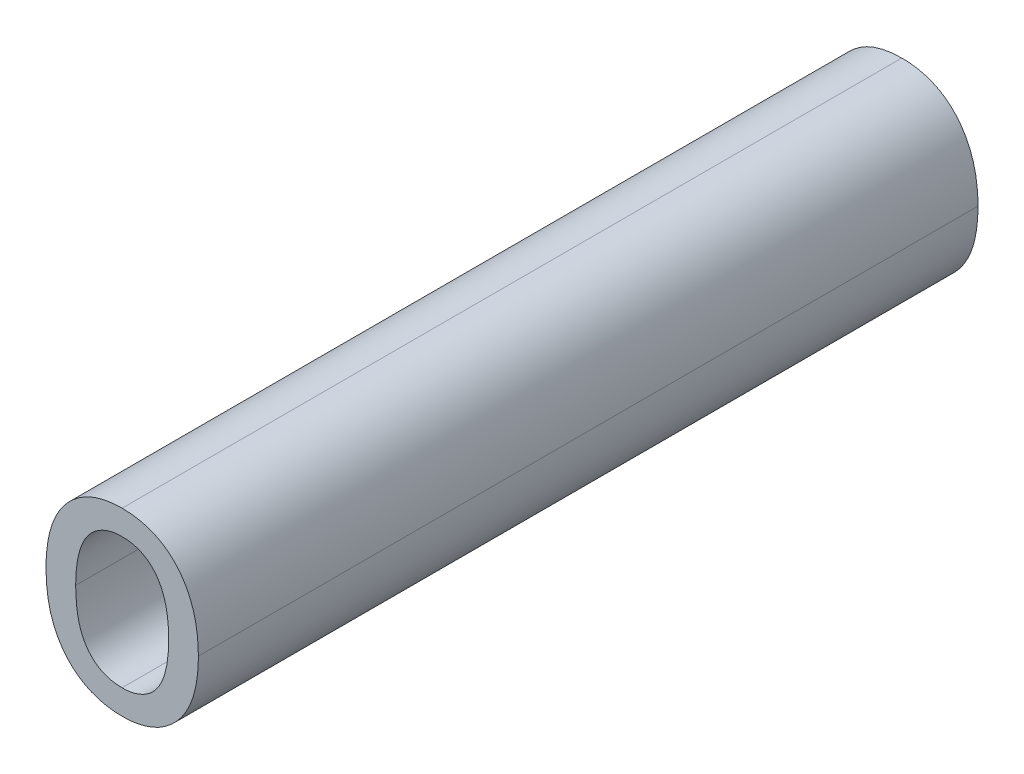
ISO-10303-21;
HEADER;
FILE_DESCRIPTION(('STEP AP214'),'2;1');
FILE_NAME('part.step','',(''),(''),'','','');
FILE_SCHEMA(('AUTOMOTIVE_DESIGN { 1 0 10303 214 1 1 1 1 }'));
ENDSEC;
DATA;
#1=APPLICATION_CONTEXT('core data for automotive mechanical design processes');
#2=APPLICATION_PROTOCOL_DEFINITION('international standard','automotive_design',2000,#1);
#3=PRODUCT_CONTEXT('',#1,'mechanical');
#4=PRODUCT('Part','Part','',(#3));
#5=PRODUCT_RELATED_PRODUCT_CATEGORY('part','',(#4));
#6=PRODUCT_DEFINITION_FORMATION('','',#4);
#7=PRODUCT_DEFINITION_CONTEXT('part definition',#1,'design');
#8=PRODUCT_DEFINITION('design','',#6,#7);
#9=PRODUCT_DEFINITION_SHAPE('','',#8);
#10=(LENGTH_UNIT() NAMED_UNIT(*) SI_UNIT(.MILLI.,.METRE.));
#11=(NAMED_UNIT(*) PLANE_ANGLE_UNIT() SI_UNIT($,.RADIAN.));
#12=(NAMED_UNIT(*) SI_UNIT($,.STERADIAN.) SOLID_ANGLE_UNIT());
#13=UNCERTAINTY_MEASURE_WITH_UNIT(LENGTH_MEASURE(1.E-05),#10,'distance_accuracy_value','');
#14=(GEOMETRIC_REPRESENTATION_CONTEXT(3) GLOBAL_UNCERTAINTY_ASSIGNED_CONTEXT((#13)) GLOBAL_UNIT_ASSIGNED_CONTEXT((#10,
#11,#12)) REPRESENTATION_CONTEXT('',''));
#15=CARTESIAN_POINT('',(0.,0.,0.));
#16=DIRECTION('',(0.,0.,1.));
#17=DIRECTION('',(1.,0.,0.));
#18=AXIS2_PLACEMENT_3D('',#15,#16,#17);
#19=CARTESIAN_POINT('',(5.160022068365,3.57282545905,0.));
#20=CARTESIAN_POINT('',(5.160022068365,3.57282545905,0.1));
#21=CARTESIAN_POINT('',(5.157186411654,3.57282545905,0.));
#22=CARTESIAN_POINT('',(5.157186411654,3.57282545905,0.1));
#23=CARTESIAN_POINT('',(5.154067189272,3.568642865401,0.));
#24=CARTESIAN_POINT('',(5.154067189272,3.568642865401,0.1));
#25=CARTESIAN_POINT('',(5.154067189272,3.56443664128,0.));
#26=CARTESIAN_POINT('',(5.154067189272,3.56443664128,0.1));
#27=B_SPLINE_SURFACE_WITH_KNOTS('',2,1,((#19,#20),(#21,#22),(#23,#24),(#25,#26)),.UNSPECIFIED.,
.F.,.F.,.F.,(3,1,3),(2,2),(0.,1.,2.),(0.,0.01),.UNSPECIFIED.);
#28=DIRECTION('',(0.,0.,1.));
#29=VECTOR('',#28,1.);
#30=CARTESIAN_POINT('',(5.160022068365,3.57282545905,0.05));
#31=LINE('',#30,#29);
#32=CARTESIAN_POINT('',(5.160022068365,3.57282545905,0.));
#33=VERTEX_POINT('',#32);
#34=CARTESIAN_POINT('',(5.160022068365,3.57282545905,0.1));
#35=VERTEX_POINT('',#34);
#36=EDGE_CURVE('E278',#33,#35,#31,.T.);
#37=CARTESIAN_POINT('',(5.154067189272,3.56443664128,0.1));
#38=CARTESIAN_POINT('',(5.15407213640399,3.56524240339555,0.1));
#39=CARTESIAN_POINT('',(5.15411038975625,3.56606073481709,0.1));
#40=CARTESIAN_POINT('',(5.15429845338534,3.56743657271248,0.1));
#41=CARTESIAN_POINT('',(5.15441210616612,3.56799994070194,0.1));
#42=CARTESIAN_POINT('',(5.15469393465122,3.56894864990823,0.1));
#43=CARTESIAN_POINT('',(5.15483886502386,3.56934072689226,0.1));
#44=CARTESIAN_POINT('',(5.15531270406141,3.57033262538186,0.1));
#45=CARTESIAN_POINT('',(5.15569998741081,3.57090895812658,0.1));
#46=CARTESIAN_POINT('',(5.15677080594161,3.57194030906049,0.1));
#47=CARTESIAN_POINT('',(5.15749572161598,3.57235353202267,0.1));
#48=CARTESIAN_POINT('',(5.15883996235041,3.57276768764731,0.1));
#49=CARTESIAN_POINT('',(5.15943599156544,3.57284911383646,0.1));
#50=CARTESIAN_POINT('',(5.160022068365,3.57282545905,0.1));
#51=B_SPLINE_CURVE_WITH_KNOTS('',3,(#37,#38,#39,#40,#41,#42,#43,#44,#45,#46,#47,#48,#49,#50),
.UNSPECIFIED.,.F.,.F.,(4,2,2,2,2,2,4),(0.,0.00243559107491018,0.0041541501792842,
0.00540516359174227,0.0074388307348185,0.00984645486338255,0.0116128709208963),.UNSPECIFIED.);
#52=CARTESIAN_POINT('',(5.154067189272,3.56443664128,0.1));
#53=VERTEX_POINT('',#52);
#54=EDGE_CURVE('E220',#53,#35,#51,.T.);
#55=DIRECTION('',(0.,0.,-1.));
#56=VECTOR('',#55,1.);
#57=CARTESIAN_POINT('',(5.154067189272,3.56443664128,0.05));
#58=LINE('',#57,#56);
#59=CARTESIAN_POINT('',(5.154067189272,3.56443664128,0.));
#60=VERTEX_POINT('',#59);
#61=EDGE_CURVE('E100',#53,#60,#58,.T.);
#62=CARTESIAN_POINT('',(5.154067189272,3.56443664128,0.));
#63=CARTESIAN_POINT('',(5.15407213640399,3.56524240339555,0.));
#64=CARTESIAN_POINT('',(5.15411038975625,3.56606073481709,0.));
#65=CARTESIAN_POINT('',(5.15429845338534,3.56743657271248,0.));
#66=CARTESIAN_POINT('',(5.15441210616612,3.56799994070194,0.));
#67=CARTESIAN_POINT('',(5.15469393465122,3.56894864990823,0.));
#68=CARTESIAN_POINT('',(5.15483886502386,3.56934072689226,0.));
#69=CARTESIAN_POINT('',(5.1553127040614,3.57033262538186,0.));
#70=CARTESIAN_POINT('',(5.15569998741081,3.57090895812658,0.));
#71=CARTESIAN_POINT('',(5.1567708059416,3.57194030906049,0.));
#72=CARTESIAN_POINT('',(5.15749572161597,3.57235353202266,0.));
#73=CARTESIAN_POINT('',(5.15883996235041,3.57276768764731,0.));
#74=CARTESIAN_POINT('',(5.15943599156544,3.57284911383646,0.));
#75=CARTESIAN_POINT('',(5.160022068365,3.57282545905,0.));
#76=B_SPLINE_CURVE_WITH_KNOTS('',3,(#62,#63,#64,#65,#66,#67,#68,#69,#70,#71,#72,#73,#74,#75),
.UNSPECIFIED.,.F.,.F.,(4,2,2,2,2,2,4),(0.,0.00243559107491018,0.0041541501792842,
0.00540516359174044,0.0074388307348146,0.00984645486338102,0.0116128709208966),.UNSPECIFIED.);
#77=EDGE_CURVE('E113',#60,#33,#76,.T.);
#78=ORIENTED_EDGE('',*,*,#36,.T.);
#79=ORIENTED_EDGE('',*,*,#54,.F.);
#80=ORIENTED_EDGE('',*,*,#61,.T.);
#81=ORIENTED_EDGE('',*,*,#77,.T.);
#82=EDGE_LOOP('',(#78,#79,#80,#81));
#83=FACE_BOUND('',#82,.T.);
#84=ADVANCED_FACE('F17',(#83),#27,.F.);
#85=CARTESIAN_POINT('',(5.166000577931,3.56443664128,0.));
#86=CARTESIAN_POINT('',(5.166000577931,3.56443664128,0.1));
#87=CARTESIAN_POINT('',(5.166000577931,3.568571973984,0.));
#88=CARTESIAN_POINT('',(5.166000577931,3.568571973984,0.1));
#89=CARTESIAN_POINT('',(5.162881355549,3.57282545905,0.));
#90=CARTESIAN_POINT('',(5.162881355549,3.57282545905,0.1));
#91=CARTESIAN_POINT('',(5.160022068365,3.57282545905,0.));
#92=CARTESIAN_POINT('',(5.160022068365,3.57282545905,0.1));
#93=B_SPLINE_SURFACE_WITH_KNOTS('',2,1,((#85,#86),(#87,#88),(#89,#90),(#91,#92)),.UNSPECIFIED.,
.F.,.F.,.F.,(3,1,3),(2,2),(0.,1.,2.),(0.,0.01),.UNSPECIFIED.);
#94=DIRECTION('',(0.,0.,1.));
#95=VECTOR('',#94,1.);
#96=CARTESIAN_POINT('',(5.166000577931,3.56443664128,0.05));
#97=LINE('',#96,#95);
#98=CARTESIAN_POINT('',(5.166000577931,3.56443664128,0.));
#99=VERTEX_POINT('',#98);
#100=CARTESIAN_POINT('',(5.166000577931,3.56443664128,0.1));
#101=VERTEX_POINT('',#100);
#102=EDGE_CURVE('E281',#99,#101,#97,.T.);
#103=CARTESIAN_POINT('',(5.160022068365,3.57282545905,0.1));
#104=CARTESIAN_POINT('',(5.16067836850044,3.57284369103014,0.1));
#105=CARTESIAN_POINT('',(5.16134691277117,3.57274421799248,0.1));
#106=CARTESIAN_POINT('',(5.16249504694325,3.5723513849407,0.1));
#107=CARTESIAN_POINT('',(5.16298744968303,3.57209379169986,0.1));
#108=CARTESIAN_POINT('',(5.16415901898271,3.57118668760229,0.1));
#109=CARTESIAN_POINT('',(5.16472584238535,3.57038894669459,0.1));
#110=CARTESIAN_POINT('',(5.16525213227935,3.56922521140758,0.1));
#111=CARTESIAN_POINT('',(5.16536856883563,3.56890746878787,0.1));
#112=CARTESIAN_POINT('',(5.16567022663872,3.56792558181007,0.1));
#113=CARTESIAN_POINT('',(5.16580141890275,3.56724417455332,0.1));
#114=CARTESIAN_POINT('',(5.16596662927742,3.56585074930513,0.1));
#115=CARTESIAN_POINT('',(5.16599808429086,3.56513839381899,0.1));
#116=CARTESIAN_POINT('',(5.166000577931,3.56443664128,0.1));
#117=B_SPLINE_CURVE_WITH_KNOTS('',3,(#103,#104,#105,#106,#107,#108,#109,#110,#111,#112,#113,
#114,#115,#116),.UNSPECIFIED.,.F.,.F.,(4,2,2,2,2,2,4),(0.,0.00197443038820868,
0.00361380410364389,0.0064065917610453,0.00742240244567767,0.00949246966802467,
0.0116153205853759),.UNSPECIFIED.);
#118=EDGE_CURVE('E214',#35,#101,#117,.T.);
#119=CARTESIAN_POINT('',(5.160022068365,3.57282545905,0.));
#120=CARTESIAN_POINT('',(5.16067836850044,3.57284369103014,0.));
#121=CARTESIAN_POINT('',(5.16134691277117,3.57274421799248,0.));
#122=CARTESIAN_POINT('',(5.16249504694325,3.5723513849407,0.));
#123=CARTESIAN_POINT('',(5.16298744968303,3.57209379169986,0.));
#124=CARTESIAN_POINT('',(5.16415901898271,3.57118668760229,0.));
#125=CARTESIAN_POINT('',(5.16472584238535,3.57038894669459,0.));
#126=CARTESIAN_POINT('',(5.16525213227935,3.56922521140758,0.));
#127=CARTESIAN_POINT('',(5.16536856883563,3.56890746878787,0.));
#128=CARTESIAN_POINT('',(5.16567022663872,3.56792558181007,0.));
#129=CARTESIAN_POINT('',(5.16580141890275,3.56724417455332,0.));
#130=CARTESIAN_POINT('',(5.16596662927742,3.56585074930513,0.));
#131=CARTESIAN_POINT('',(5.16599808429086,3.56513839381899,0.));
#132=CARTESIAN_POINT('',(5.166000577931,3.56443664128,0.));
#133=B_SPLINE_CURVE_WITH_KNOTS('',3,(#119,#120,#121,#122,#123,#124,#125,#126,#127,#128,#129,
#130,#131,#132),.UNSPECIFIED.,.F.,.F.,(4,2,2,2,2,2,4),(0.,0.00197443038820868,
0.00361380410364389,0.0064065917610453,0.00742240244567767,0.00949246966802467,
0.0116153205853759),.UNSPECIFIED.);
#134=EDGE_CURVE('E99',#33,#99,#133,.T.);
#135=ORIENTED_EDGE('',*,*,#102,.T.);
#136=ORIENTED_EDGE('',*,*,#118,.F.);
#137=ORIENTED_EDGE('',*,*,#36,.F.);
#138=ORIENTED_EDGE('',*,*,#134,.T.);
#139=EDGE_LOOP('',(#135,#136,#137,#138));
#140=FACE_BOUND('',#139,.T.);
#141=ADVANCED_FACE('F230',(#140),#93,.F.);
#142=CARTESIAN_POINT('',(5.160022068365,3.55604782351,0.));
#143=CARTESIAN_POINT('',(5.160022068365,3.55604782351,0.1));
#144=CARTESIAN_POINT('',(5.162881355549,3.55604782351,0.));
#145=CARTESIAN_POINT('',(5.162881355549,3.55604782351,0.1));
#146=CARTESIAN_POINT('',(5.166000577931,3.560183156214,0.));
#147=CARTESIAN_POINT('',(5.166000577931,3.560183156214,0.1));
#148=CARTESIAN_POINT('',(5.166000577931,3.56443664128,0.));
#149=CARTESIAN_POINT('',(5.166000577931,3.56443664128,0.1));
#150=B_SPLINE_SURFACE_WITH_KNOTS('',2,1,((#142,#143),(#144,#145),(#146,#147),(#148,#149)),
.UNSPECIFIED.,.F.,.F.,.F.,(3,1,3),(2,2),(0.,1.,2.),(0.,0.01),.UNSPECIFIED.);
#151=DIRECTION('',(0.,0.,1.));
#152=VECTOR('',#151,1.);
#153=CARTESIAN_POINT('',(5.160022068365,3.55604782351,0.05));
#154=LINE('',#153,#152);
#155=CARTESIAN_POINT('',(5.160022068365,3.55604782351,0.));
#156=VERTEX_POINT('',#155);
#157=CARTESIAN_POINT('',(5.160022068365,3.55604782351,0.1));
#158=VERTEX_POINT('',#157);
#159=EDGE_CURVE('E274',#156,#158,#154,.T.);
#160=CARTESIAN_POINT('',(5.166000577931,3.56443664128,0.1));
#161=CARTESIAN_POINT('',(5.16599520764222,3.56362288603922,0.1));
#162=CARTESIAN_POINT('',(5.16595751287495,3.56279625124608,0.1));
#163=CARTESIAN_POINT('',(5.16576988852083,3.56141450256105,0.1));
#164=CARTESIAN_POINT('',(5.16565759395648,3.56085329541434,0.1));
#165=CARTESIAN_POINT('',(5.16537971169692,3.55991058555626,0.1));
#166=CARTESIAN_POINT('',(5.16523751739915,3.55952238256947,0.1));
#167=CARTESIAN_POINT('',(5.16477460834869,3.55854738018926,0.1));
#168=CARTESIAN_POINT('',(5.1643979239808,3.5579830218377,0.1));
#169=CARTESIAN_POINT('',(5.16330531685985,3.55691991413148,0.1));
#170=CARTESIAN_POINT('',(5.16252261631469,3.55648790786856,0.1));
#171=CARTESIAN_POINT('',(5.16114442600851,3.55609710400676,0.1));
#172=CARTESIAN_POINT('',(5.16057758478989,3.55602643161426,0.1));
#173=CARTESIAN_POINT('',(5.160022068365,3.55604782351,0.1));
#174=B_SPLINE_CURVE_WITH_KNOTS('',3,(#160,#161,#162,#163,#164,#165,#166,#167,#168,#169,#170,
#171,#172,#173),.UNSPECIFIED.,.F.,.F.,(4,2,2,2,2,2,4),(0.,0.00246002094616378,
0.00417161242150578,0.00540887154226146,0.00739694752425715,0.00996284919446372,
0.011642967252916),.UNSPECIFIED.);
#175=EDGE_CURVE('E183',#101,#158,#174,.T.);
#176=CARTESIAN_POINT('',(5.166000577931,3.56443664128,0.));
#177=CARTESIAN_POINT('',(5.16599520764222,3.56362288603922,0.));
#178=CARTESIAN_POINT('',(5.16595751287495,3.56279625124608,0.));
#179=CARTESIAN_POINT('',(5.16576988852083,3.56141450256105,0.));
#180=CARTESIAN_POINT('',(5.16565759395648,3.56085329541434,0.));
#181=CARTESIAN_POINT('',(5.16537971169692,3.55991058555626,0.));
#182=CARTESIAN_POINT('',(5.16523751739915,3.55952238256947,0.));
#183=CARTESIAN_POINT('',(5.16477460834869,3.55854738018926,0.));
#184=CARTESIAN_POINT('',(5.1643979239808,3.5579830218377,0.));
#185=CARTESIAN_POINT('',(5.16330531685986,3.55691991413148,0.));
#186=CARTESIAN_POINT('',(5.16252261631469,3.55648790786856,0.));
#187=CARTESIAN_POINT('',(5.16114442600851,3.55609710400676,0.));
#188=CARTESIAN_POINT('',(5.1605775847899,3.55602643161426,0.));
#189=CARTESIAN_POINT('',(5.160022068365,3.55604782351,0.));
#190=B_SPLINE_CURVE_WITH_KNOTS('',3,(#176,#177,#178,#179,#180,#181,#182,#183,#184,#185,#186,
#187,#188,#189),.UNSPECIFIED.,.F.,.F.,(4,2,2,2,2,2,4),(0.,0.00246002094616378,
0.00417161242150578,0.00540887154226146,0.0073969475242563,0.00996284919445964,
0.0116429672529164),.UNSPECIFIED.);
#191=EDGE_CURVE('E258',#99,#156,#190,.T.);
#192=ORIENTED_EDGE('',*,*,#159,.T.);
#193=ORIENTED_EDGE('',*,*,#175,.F.);
#194=ORIENTED_EDGE('',*,*,#102,.F.);
#195=ORIENTED_EDGE('',*,*,#191,.T.);
#196=EDGE_LOOP('',(#192,#193,#194,#195));
#197=FACE_BOUND('',#196,.T.);
#198=ADVANCED_FACE('F242',(#197),#150,.F.);
#199=CARTESIAN_POINT('',(5.154067189272,3.56443664128,0.));
#200=CARTESIAN_POINT('',(5.154067189272,3.56443664128,0.1));
#201=CARTESIAN_POINT('',(5.154067189272,3.560183156214,0.));
#202=CARTESIAN_POINT('',(5.154067189272,3.560183156214,0.1));
#203=CARTESIAN_POINT('',(5.157162781182,3.55604782351,0.));
#204=CARTESIAN_POINT('',(5.157162781182,3.55604782351,0.1));
#205=CARTESIAN_POINT('',(5.160022068365,3.55604782351,0.));
#206=CARTESIAN_POINT('',(5.160022068365,3.55604782351,0.1));
#207=B_SPLINE_SURFACE_WITH_KNOTS('',2,1,((#199,#200),(#201,#202),(#203,#204),(#205,#206)),
.UNSPECIFIED.,.F.,.F.,.F.,(3,1,3),(2,2),(0.,1.,2.),(0.,0.01),.UNSPECIFIED.);
#208=CARTESIAN_POINT('',(5.160022068365,3.55604782351,0.1));
#209=CARTESIAN_POINT('',(5.15935517387647,3.55602972965599,0.1));
#210=CARTESIAN_POINT('',(5.15867260340631,3.55612973300442,0.1));
#211=CARTESIAN_POINT('',(5.15751207418624,3.55652611313722,0.1));
#212=CARTESIAN_POINT('',(5.15701966989765,3.55678251406867,0.1));
#213=CARTESIAN_POINT('',(5.15594576460724,3.55761474565937,0.1));
#214=CARTESIAN_POINT('',(5.15543617133427,3.55828505814391,0.1));
#215=CARTESIAN_POINT('',(5.15465758600742,3.55981695694746,0.1));
#216=CARTESIAN_POINT('',(5.15442040815178,3.56069136704124,0.1));
#217=CARTESIAN_POINT('',(5.15413011004346,3.56253418814366,0.1));
#218=CARTESIAN_POINT('',(5.15408952035052,3.56350505116148,0.1));
#219=CARTESIAN_POINT('',(5.154067189272,3.56443664128,0.1));
#220=B_SPLINE_CURVE_WITH_KNOTS('',3,(#208,#209,#210,#211,#212,#213,#214,#215,#216,#217,#218,
#219),.UNSPECIFIED.,.F.,.F.,(4,2,2,2,2,4),(0.,0.00201177035422085,0.00364943171414231,
0.00607837549277591,0.00876885084016543,0.011628745293236),.UNSPECIFIED.);
#221=EDGE_CURVE('E176',#158,#53,#220,.T.);
#222=CARTESIAN_POINT('',(5.160022068365,3.55604782351,0.));
#223=CARTESIAN_POINT('',(5.15935517387647,3.55602972965599,0.));
#224=CARTESIAN_POINT('',(5.15867260340631,3.55612973300442,0.));
#225=CARTESIAN_POINT('',(5.15751207418624,3.55652611313722,0.));
#226=CARTESIAN_POINT('',(5.15701966989765,3.55678251406867,0.));
#227=CARTESIAN_POINT('',(5.15594576460724,3.55761474565937,0.));
#228=CARTESIAN_POINT('',(5.15543617133427,3.55828505814391,0.));
#229=CARTESIAN_POINT('',(5.15465758600742,3.55981695694746,0.));
#230=CARTESIAN_POINT('',(5.15442040815178,3.56069136704124,0.));
#231=CARTESIAN_POINT('',(5.15413011004345,3.56253418814366,0.));
#232=CARTESIAN_POINT('',(5.15408952035052,3.56350505116148,0.));
#233=CARTESIAN_POINT('',(5.154067189272,3.56443664128,0.));
#234=B_SPLINE_CURVE_WITH_KNOTS('',3,(#222,#223,#224,#225,#226,#227,#228,#229,#230,#231,#232,
#233),.UNSPECIFIED.,.F.,.F.,(4,2,2,2,2,4),(0.,0.00201177035422085,0.00364943171414231,
0.00607837549277591,0.00876885084016485,0.0116287452932362),.UNSPECIFIED.);
#235=EDGE_CURVE('E116',#156,#60,#234,.T.);
#236=ORIENTED_EDGE('',*,*,#61,.F.);
#237=ORIENTED_EDGE('',*,*,#221,.F.);
#238=ORIENTED_EDGE('',*,*,#159,.F.);
#239=ORIENTED_EDGE('',*,*,#235,.T.);
#240=EDGE_LOOP('',(#236,#237,#238,#239));
#241=FACE_BOUND('',#240,.T.);
#242=ADVANCED_FACE('F190',(#241),#207,.F.);
#243=CARTESIAN_POINT('',(5.150262683185,3.56443664128,0.));
#244=CARTESIAN_POINT('',(5.150262683185,3.56443664128,0.1));
#245=CARTESIAN_POINT('',(5.150262683185,3.558930741166,0.));
#246=CARTESIAN_POINT('',(5.150262683185,3.558930741166,0.1));
#247=CARTESIAN_POINT('',(5.155579539518,3.552881340183,0.));
#248=CARTESIAN_POINT('',(5.155579539518,3.552881340183,0.1));
#249=CARTESIAN_POINT('',(5.160022068365,3.552881340183,0.));
#250=CARTESIAN_POINT('',(5.160022068365,3.552881340183,0.1));
#251=B_SPLINE_SURFACE_WITH_KNOTS('',2,1,((#243,#244),(#245,#246),(#247,#248),(#249,#250)),
.UNSPECIFIED.,.F.,.F.,.F.,(3,1,3),(2,2),(-2.,-1.,0.),(0.,0.01),.UNSPECIFIED.);
#252=CARTESIAN_POINT('',(5.150262683185,3.56443664128,0.1));
#253=CARTESIAN_POINT('',(5.15026816709451,3.56348651757835,0.1));
#254=CARTESIAN_POINT('',(5.15032354202922,3.56253098499129,0.1));
#255=CARTESIAN_POINT('',(5.15057288519651,3.56086815986953,0.1));
#256=CARTESIAN_POINT('',(5.15073139097482,3.56015509971552,0.1));
#257=CARTESIAN_POINT('',(5.15132634037976,3.55831433030803,0.1));
#258=CARTESIAN_POINT('',(5.15187604908624,3.55721539497639,0.1));
#259=CARTESIAN_POINT('',(5.15296389530087,3.55582911765647,0.1));
#260=CARTESIAN_POINT('',(5.15335232602344,3.55542120913695,0.1));
#261=CARTESIAN_POINT('',(5.15412907645561,3.55474357761399,0.1));
#262=CARTESIAN_POINT('',(5.15450716127475,3.55446217098011,0.1));
#263=CARTESIAN_POINT('',(5.15571034511071,3.55372184293781,0.1));
#264=CARTESIAN_POINT('',(5.15660194031123,3.55336983432839,0.1));
#265=CARTESIAN_POINT('',(5.15834574315306,3.5529578165819,0.1));
#266=CARTESIAN_POINT('',(5.15919127834601,3.5528696530695,0.1));
#267=CARTESIAN_POINT('',(5.160022068365,3.552881340183,0.1));
#268=B_SPLINE_CURVE_WITH_KNOTS('',3,(#252,#253,#254,#255,#256,#257,#258,#259,#260,#261,#262,
#263,#264,#265,#266,#267),.UNSPECIFIED.,.F.,.F.,(4,2,2,2,2,2,2,4),(0.,0.00285439185616727,
0.00504086447419834,0.00863575622298341,0.0103163987526974,0.0117239910911656,0.014550149536326,
0.0170615527036299),.UNSPECIFIED.);
#269=CARTESIAN_POINT('',(5.150262683185,3.56443664128,0.1));
#270=VERTEX_POINT('',#269);
#271=CARTESIAN_POINT('',(5.160022068365,3.552881340183,0.1));
#272=VERTEX_POINT('',#271);
#273=EDGE_CURVE('E104',#270,#272,#268,.T.);
#274=DIRECTION('',(0.,0.,1.));
#275=VECTOR('',#274,1.);
#276=CARTESIAN_POINT('',(5.150262683185,3.56443664128,0.05));
#277=LINE('',#276,#275);
#278=CARTESIAN_POINT('',(5.150262683185,3.56443664128,0.));
#279=VERTEX_POINT('',#278);
#280=EDGE_CURVE('E102',#279,#270,#277,.T.);
#281=CARTESIAN_POINT('',(5.150262683185,3.56443664128,0.));
#282=CARTESIAN_POINT('',(5.15026816709451,3.56348651757835,0.));
#283=CARTESIAN_POINT('',(5.15032354202922,3.56253098499129,0.));
#284=CARTESIAN_POINT('',(5.15057288519651,3.56086815986953,0.));
#285=CARTESIAN_POINT('',(5.15073139097482,3.56015509971552,0.));
#286=CARTESIAN_POINT('',(5.15132634037976,3.55831433030803,0.));
#287=CARTESIAN_POINT('',(5.15187604908624,3.55721539497639,0.));
#288=CARTESIAN_POINT('',(5.15296389530087,3.55582911765647,0.));
#289=CARTESIAN_POINT('',(5.15335232602344,3.55542120913695,0.));
#290=CARTESIAN_POINT('',(5.15412907645561,3.55474357761399,0.));
#291=CARTESIAN_POINT('',(5.15450716127475,3.55446217098011,0.));
#292=CARTESIAN_POINT('',(5.15571034511071,3.55372184293781,0.));
#293=CARTESIAN_POINT('',(5.15660194031123,3.55336983432839,0.));
#294=CARTESIAN_POINT('',(5.15834574315306,3.5529578165819,0.));
#295=CARTESIAN_POINT('',(5.15919127834601,3.5528696530695,0.));
#296=CARTESIAN_POINT('',(5.160022068365,3.552881340183,0.));
#297=B_SPLINE_CURVE_WITH_KNOTS('',3,(#281,#282,#283,#284,#285,#286,#287,#288,#289,#290,#291,
#292,#293,#294,#295,#296),.UNSPECIFIED.,.F.,.F.,(4,2,2,2,2,2,2,4),(0.,0.00285439185616727,
0.00504086447419834,0.00863575622298341,0.0103163987526974,0.0117239910911656,0.014550149536326,
0.0170615527036299),.UNSPECIFIED.);
#298=CARTESIAN_POINT('',(5.160022068365,3.552881340183,0.));
#299=VERTEX_POINT('',#298);
#300=EDGE_CURVE('E24',#279,#299,#297,.T.);
#301=DIRECTION('',(0.,0.,-1.));
#302=VECTOR('',#301,1.);
#303=CARTESIAN_POINT('',(5.160022068365,3.552881340183,0.05));
#304=LINE('',#303,#302);
#305=EDGE_CURVE('E303',#272,#299,#304,.T.);
#306=ORIENTED_EDGE('',*,*,#273,.F.);
#307=ORIENTED_EDGE('',*,*,#280,.F.);
#308=ORIENTED_EDGE('',*,*,#300,.T.);
#309=ORIENTED_EDGE('',*,*,#305,.F.);
#310=EDGE_LOOP('',(#306,#307,#308,#309));
#311=FACE_BOUND('',#310,.T.);
#312=ADVANCED_FACE('F103',(#311),#251,.T.);
#313=CARTESIAN_POINT('',(5.160023291942,3.564442207285,0.));
#314=DIRECTION('',(0.,0.,1.));
#315=DIRECTION('',(1.,0.,0.));
#316=AXIS2_PLACEMENT_3D('',#313,#314,#315);
#317=PLANE('',#316);
#318=ORIENTED_EDGE('',*,*,#235,.F.);
#319=ORIENTED_EDGE('',*,*,#191,.F.);
#320=ORIENTED_EDGE('',*,*,#134,.F.);
#321=ORIENTED_EDGE('',*,*,#77,.F.);
#322=EDGE_LOOP('',(#318,#319,#320,#321));
#323=FACE_BOUND('',#322,.T.);
#324=CARTESIAN_POINT('',(5.169805084018,3.56443664128,0.));
#325=CARTESIAN_POINT('',(5.16980089891826,3.56537076146654,0.));
#326=CARTESIAN_POINT('',(5.16974388192714,3.56630965154184,0.));
#327=CARTESIAN_POINT('',(5.16949260216766,3.56796049846629,0.));
#328=CARTESIAN_POINT('',(5.16933058069287,3.56867773851513,0.));
#329=CARTESIAN_POINT('',(5.16871784334415,3.57055420268656,0.));
#330=CARTESIAN_POINT('',(5.16814565259086,3.57168168585209,0.));
#331=CARTESIAN_POINT('',(5.16708868637911,3.57302679542517,0.));
#332=CARTESIAN_POINT('',(5.16676682976985,3.57337733824628,0.));
#333=CARTESIAN_POINT('',(5.16608081293683,3.57401148747208,0.));
#334=CARTESIAN_POINT('',(5.16571833846316,3.57429687862098,0.));
#335=CARTESIAN_POINT('',(5.16456312703819,3.5750515934168,0.));
#336=CARTESIAN_POINT('',(5.16370337110426,3.57541845016838,0.));
#337=CARTESIAN_POINT('',(5.1618972755625,3.57589889686494,0.));
#338=CARTESIAN_POINT('',(5.16094968476363,3.57600794569585,0.));
#339=CARTESIAN_POINT('',(5.160022068365,3.575991942377,0.));
#340=B_SPLINE_CURVE_WITH_KNOTS('',3,(#324,#325,#326,#327,#328,#329,#330,#331,#332,#333,#334,
#335,#336,#337,#338,#339),.UNSPECIFIED.,.F.,.F.,(4,2,2,2,2,2,2,4),(0.,0.00280545126160214,
0.00500603400970742,0.00870564196978287,0.0101284166421408,0.0115056070460231,
0.0142635703422861,0.0170697627065887),.UNSPECIFIED.);
#341=CARTESIAN_POINT('',(5.169805084018,3.56443664128,0.));
#342=VERTEX_POINT('',#341);
#343=CARTESIAN_POINT('',(5.160022068365,3.575991942377,0.));
#344=VERTEX_POINT('',#343);
#345=EDGE_CURVE('E301',#342,#344,#340,.T.);
#346=ORIENTED_EDGE('',*,*,#345,.F.);
#347=CARTESIAN_POINT('',(5.160022068365,3.552881340183,0.));
#348=CARTESIAN_POINT('',(5.16113602055376,3.55286770938172,0.));
#349=CARTESIAN_POINT('',(5.16225930853435,3.55302972062103,0.));
#350=CARTESIAN_POINT('',(5.16383838059648,3.55355865717046,0.));
#351=CARTESIAN_POINT('',(5.16434550935022,3.55378135524571,0.));
#352=CARTESIAN_POINT('',(5.16566727741076,3.55452857896293,0.));
#353=CARTESIAN_POINT('',(5.16642779934173,3.55515424360898,0.));
#354=CARTESIAN_POINT('',(5.16740346340948,3.55624421426111,0.));
#355=CARTESIAN_POINT('',(5.16770378661746,3.55663860671846,0.));
#356=CARTESIAN_POINT('',(5.16823819970359,3.55747068258787,0.));
#357=CARTESIAN_POINT('',(5.16847231374221,3.55790835012949,0.));
#358=CARTESIAN_POINT('',(5.16895390520462,3.55898392163942,0.));
#359=CARTESIAN_POINT('',(5.16917213647433,3.55963429693718,0.));
#360=CARTESIAN_POINT('',(5.16967804484703,3.56164980734823,0.));
#361=CARTESIAN_POINT('',(5.16980552388885,3.56306082357625,0.));
#362=CARTESIAN_POINT('',(5.169805084018,3.56443664128,0.));
#363=B_SPLINE_CURVE_WITH_KNOTS('',3,(#347,#348,#349,#350,#351,#352,#353,#354,#355,#356,#357,
#358,#359,#360,#361,#362),.UNSPECIFIED.,.F.,.F.,(4,2,2,2,2,2,2,4),(0.,0.00333040426639151,
0.00498412040510889,0.00787626158996823,0.00935923988651604,0.0108416763276505,
0.0128920857553333,0.0170555262283517),.UNSPECIFIED.);
#364=EDGE_CURVE('E95',#299,#342,#363,.T.);
#365=ORIENTED_EDGE('',*,*,#364,.F.);
#366=ORIENTED_EDGE('',*,*,#300,.F.);
#367=CARTESIAN_POINT('',(5.160022068365,3.575991942377,0.));
#368=CARTESIAN_POINT('',(5.15888944872144,3.57600072226116,0.));
#369=CARTESIAN_POINT('',(5.15774529639601,3.57584168131036,0.));
#370=CARTESIAN_POINT('',(5.15622400829239,3.5753334416255,0.));
#371=CARTESIAN_POINT('',(5.15578822617366,3.57514892213759,0.));
#372=CARTESIAN_POINT('',(5.1545398692977,3.57448607599313,0.));
#373=CARTESIAN_POINT('',(5.15378184496232,3.57389779635365,0.));
#374=CARTESIAN_POINT('',(5.15280560695956,3.57286507877529,0.));
#375=CARTESIAN_POINT('',(5.15250513092438,3.57249192113807,0.));
#376=CARTESIAN_POINT('',(5.15169350923571,3.57129981196903,0.));
#377=CARTESIAN_POINT('',(5.15127839645962,3.57041305384443,0.));
#378=CARTESIAN_POINT('',(5.15080092132931,3.56895553617722,0.));
#379=CARTESIAN_POINT('',(5.15066369151342,3.56840499934281,0.));
#380=CARTESIAN_POINT('',(5.15034790095689,3.56672583517953,0.));
#381=CARTESIAN_POINT('',(5.1502686277062,3.56557730632942,0.));
#382=CARTESIAN_POINT('',(5.150262683185,3.56443664128,0.));
#383=B_SPLINE_CURVE_WITH_KNOTS('',3,(#367,#368,#369,#370,#371,#372,#373,#374,#375,#376,#377,
#378,#379,#380,#381,#382),.UNSPECIFIED.,.F.,.F.,(4,2,2,2,2,2,2,4),(0.,0.00338830309846737,
0.00480338220449864,0.00762074247486871,0.0090542365419062,0.0119438200480288,0.013643646355048,
0.0170677986186863),.UNSPECIFIED.);
#384=EDGE_CURVE('E92',#344,#279,#383,.T.);
#385=ORIENTED_EDGE('',*,*,#384,.F.);
#386=EDGE_LOOP('',(#346,#365,#366,#385));
#387=FACE_BOUND('',#386,.T.);
#388=ADVANCED_FACE('F90',(#323,#387),#317,.F.);
#389=CARTESIAN_POINT('',(5.160022068365,3.575991942377,0.));
#390=CARTESIAN_POINT('',(5.160022068365,3.575991942377,0.1));
#391=CARTESIAN_POINT('',(5.155579539518,3.575991942377,0.));
#392=CARTESIAN_POINT('',(5.155579539518,3.575991942377,0.1));
#393=CARTESIAN_POINT('',(5.150262683185,3.569966171867,0.));
#394=CARTESIAN_POINT('',(5.150262683185,3.569966171867,0.1));
#395=CARTESIAN_POINT('',(5.150262683185,3.56443664128,0.));
#396=CARTESIAN_POINT('',(5.150262683185,3.56443664128,0.1));
#397=B_SPLINE_SURFACE_WITH_KNOTS('',2,1,((#389,#390),(#391,#392),(#393,#394),(#395,#396)),
.UNSPECIFIED.,.F.,.F.,.F.,(3,1,3),(2,2),(-2.,-1.,0.),(0.,0.01),.UNSPECIFIED.);
#398=CARTESIAN_POINT('',(5.160022068365,3.575991942377,0.1));
#399=CARTESIAN_POINT('',(5.15888944872144,3.57600072226116,0.1));
#400=CARTESIAN_POINT('',(5.15774529639601,3.57584168131036,0.1));
#401=CARTESIAN_POINT('',(5.15622400829239,3.5753334416255,0.1));
#402=CARTESIAN_POINT('',(5.15578822617366,3.57514892213759,0.1));
#403=CARTESIAN_POINT('',(5.1545398692977,3.57448607599313,0.1));
#404=CARTESIAN_POINT('',(5.15378184496232,3.57389779635365,0.1));
#405=CARTESIAN_POINT('',(5.15280560695956,3.57286507877529,0.1));
#406=CARTESIAN_POINT('',(5.15250513092438,3.57249192113807,0.1));
#407=CARTESIAN_POINT('',(5.15169350923571,3.57129981196903,0.1));
#408=CARTESIAN_POINT('',(5.15127839645962,3.57041305384443,0.1));
#409=CARTESIAN_POINT('',(5.15080092132931,3.56895553617722,0.1));
#410=CARTESIAN_POINT('',(5.15066369151342,3.56840499934281,0.1));
#411=CARTESIAN_POINT('',(5.15034790095689,3.56672583517953,0.1));
#412=CARTESIAN_POINT('',(5.1502686277062,3.56557730632942,0.1));
#413=CARTESIAN_POINT('',(5.150262683185,3.56443664128,0.1));
#414=B_SPLINE_CURVE_WITH_KNOTS('',3,(#398,#399,#400,#401,#402,#403,#404,#405,#406,#407,#408,
#409,#410,#411,#412,#413),.UNSPECIFIED.,.F.,.F.,(4,2,2,2,2,2,2,4),(0.,0.00338830309846737,
0.00480338220449864,0.00762074247486871,0.0090542365419062,0.0119438200480288,0.013643646355048,
0.0170677986186863),.UNSPECIFIED.);
#415=CARTESIAN_POINT('',(5.160022068365,3.575991942377,0.1));
#416=VERTEX_POINT('',#415);
#417=EDGE_CURVE('E107',#416,#270,#414,.T.);
#418=DIRECTION('',(0.,0.,1.));
#419=VECTOR('',#418,1.);
#420=CARTESIAN_POINT('',(5.160022068365,3.575991942377,0.05));
#421=LINE('',#420,#419);
#422=EDGE_CURVE('E111',#344,#416,#421,.T.);
#423=ORIENTED_EDGE('',*,*,#417,.F.);
#424=ORIENTED_EDGE('',*,*,#422,.F.);
#425=ORIENTED_EDGE('',*,*,#384,.T.);
#426=ORIENTED_EDGE('',*,*,#280,.T.);
#427=EDGE_LOOP('',(#423,#424,#425,#426));
#428=FACE_BOUND('',#427,.T.);
#429=ADVANCED_FACE('F109',(#428),#397,.T.);
#430=CARTESIAN_POINT('',(5.160023291942,3.564442207285,0.1));
#431=DIRECTION('',(0.,0.,1.));
#432=DIRECTION('',(1.,0.,0.));
#433=AXIS2_PLACEMENT_3D('',#430,#431,#432);
#434=PLANE('',#433);
#435=ORIENTED_EDGE('',*,*,#175,.T.);
#436=ORIENTED_EDGE('',*,*,#221,.T.);
#437=ORIENTED_EDGE('',*,*,#54,.T.);
#438=ORIENTED_EDGE('',*,*,#118,.T.);
#439=EDGE_LOOP('',(#435,#436,#437,#438));
#440=FACE_BOUND('',#439,.T.);
#441=CARTESIAN_POINT('',(5.169805084018,3.56443664128,0.1));
#442=CARTESIAN_POINT('',(5.16980012593729,3.56350808519425,0.1));
#443=CARTESIAN_POINT('',(5.16974569469709,3.56257444347957,0.1));
#444=CARTESIAN_POINT('',(5.16950132133381,3.56093345495008,0.1));
#445=CARTESIAN_POINT('',(5.16934333895082,3.56022095601818,0.1));
#446=CARTESIAN_POINT('',(5.16874834875228,3.55837819212162,0.1));
#447=CARTESIAN_POINT('',(5.16819675345829,3.55727719290956,0.1));
#448=CARTESIAN_POINT('',(5.1671073580392,3.55588496294513,0.1));
#449=CARTESIAN_POINT('',(5.16671782704712,3.55547422547393,0.1));
#450=CARTESIAN_POINT('',(5.16593439172776,3.55478417964115,0.1));
#451=CARTESIAN_POINT('',(5.16554974113714,3.55449441062709,0.1));
#452=CARTESIAN_POINT('',(5.16433411105688,3.55373801504552,0.1));
#453=CARTESIAN_POINT('',(5.16343602784066,3.55337747973125,0.1));
#454=CARTESIAN_POINT('',(5.16168980733181,3.55295901343873,0.1));
#455=CARTESIAN_POINT('',(5.16084930958576,3.55286907363498,0.1));
#456=CARTESIAN_POINT('',(5.160022068365,3.552881340183,0.1));
#457=B_SPLINE_CURVE_WITH_KNOTS('',3,(#441,#442,#443,#444,#445,#446,#447,#448,#449,#450,#451,
#452,#453,#454,#455,#456),.UNSPECIFIED.,.F.,.F.,(4,2,2,2,2,2,2,4),(0.,0.00278944602418803,
0.00497374412895399,0.00857690273586295,0.0102663683748612,0.0117047477639976,
0.0145568402956434,0.0170548788910919),.UNSPECIFIED.);
#458=CARTESIAN_POINT('',(5.169805084018,3.56443664128,0.1));
#459=VERTEX_POINT('',#458);
#460=EDGE_CURVE('E45',#459,#272,#457,.T.);
#461=ORIENTED_EDGE('',*,*,#460,.F.);
#462=CARTESIAN_POINT('',(5.160022068365,3.575991942377,0.1));
#463=CARTESIAN_POINT('',(5.16116469212005,3.57599914144509,0.1));
#464=CARTESIAN_POINT('',(5.16232250724682,3.57584197558795,0.1));
#465=CARTESIAN_POINT('',(5.16384441273262,3.57533220987405,0.1));
#466=CARTESIAN_POINT('',(5.16427036563923,3.57515186620612,0.1));
#467=CARTESIAN_POINT('',(5.16548708271697,3.57450559886161,0.1));
#468=CARTESIAN_POINT('',(5.16622524448828,3.57393315850369,0.1));
#469=CARTESIAN_POINT('',(5.16717244937094,3.57292977262022,0.1));
#470=CARTESIAN_POINT('',(5.16746265537181,3.57256880180462,0.1));
#471=CARTESIAN_POINT('',(5.16805858767465,3.5717102527461,0.1));
#472=CARTESIAN_POINT('',(5.16834870836159,3.57120156687486,0.1));
#473=CARTESIAN_POINT('',(5.16909074975514,3.56960874683124,0.1));
#474=CARTESIAN_POINT('',(5.16940829688916,3.56846428431018,0.1));
#475=CARTESIAN_POINT('',(5.1697438076576,3.56634807770953,0.1));
#476=CARTESIAN_POINT('',(5.16980622976103,3.56538341761334,0.1));
#477=CARTESIAN_POINT('',(5.169805084018,3.56443664128,0.1));
#478=B_SPLINE_CURVE_WITH_KNOTS('',3,(#462,#463,#464,#465,#466,#467,#468,#469,#470,#471,#472,
#473,#474,#475,#476,#477),.UNSPECIFIED.,.F.,.F.,(4,2,2,2,2,2,2,4),(0.,0.00342297763091166,
0.00480631044492314,0.00754834126369453,0.00893466438085165,0.0106816666056626,
0.0142006935813171,0.0170705623770223),.UNSPECIFIED.);
#479=EDGE_CURVE('E36',#416,#459,#478,.T.);
#480=ORIENTED_EDGE('',*,*,#479,.F.);
#481=ORIENTED_EDGE('',*,*,#417,.T.);
#482=ORIENTED_EDGE('',*,*,#273,.T.);
#483=EDGE_LOOP('',(#461,#480,#481,#482));
#484=FACE_BOUND('',#483,.T.);
#485=ADVANCED_FACE('F141',(#440,#484),#434,.T.);
#486=CARTESIAN_POINT('',(5.160022068365,3.552881340183,0.));
#487=CARTESIAN_POINT('',(5.160022068365,3.552881340183,0.1));
#488=CARTESIAN_POINT('',(5.164417336267,3.552881340183,0.));
#489=CARTESIAN_POINT('',(5.164417336267,3.552881340183,0.1));
#490=CARTESIAN_POINT('',(5.169805084018,3.558954371639,0.));
#491=CARTESIAN_POINT('',(5.169805084018,3.558954371639,0.1));
#492=CARTESIAN_POINT('',(5.169805084018,3.56443664128,0.));
#493=CARTESIAN_POINT('',(5.169805084018,3.56443664128,0.1));
#494=B_SPLINE_SURFACE_WITH_KNOTS('',2,1,((#486,#487),(#488,#489),(#490,#491),(#492,#493)),
.UNSPECIFIED.,.F.,.F.,.F.,(3,1,3),(2,2),(-2.,-1.,0.),(0.,0.01),.UNSPECIFIED.);
#495=DIRECTION('',(0.,0.,-1.));
#496=VECTOR('',#495,1.);
#497=CARTESIAN_POINT('',(5.169805084018,3.56443664128,0.05));
#498=LINE('',#497,#496);
#499=EDGE_CURVE('E11',#459,#342,#498,.T.);
#500=ORIENTED_EDGE('',*,*,#460,.T.);
#501=ORIENTED_EDGE('',*,*,#305,.T.);
#502=ORIENTED_EDGE('',*,*,#364,.T.);
#503=ORIENTED_EDGE('',*,*,#499,.F.);
#504=EDGE_LOOP('',(#500,#501,#502,#503));
#505=FACE_BOUND('',#504,.T.);
#506=ADVANCED_FACE('F146',(#505),#494,.T.);
#507=CARTESIAN_POINT('',(5.169805084018,3.56443664128,0.));
#508=CARTESIAN_POINT('',(5.169805084018,3.56443664128,0.1));
#509=CARTESIAN_POINT('',(5.169805084018,3.569777128086,0.));
#510=CARTESIAN_POINT('',(5.169805084018,3.569777128086,0.1));
#511=CARTESIAN_POINT('',(5.164582749575,3.575991942377,0.));
#512=CARTESIAN_POINT('',(5.164582749575,3.575991942377,0.1));
#513=CARTESIAN_POINT('',(5.160022068365,3.575991942377,0.));
#514=CARTESIAN_POINT('',(5.160022068365,3.575991942377,0.1));
#515=B_SPLINE_SURFACE_WITH_KNOTS('',2,1,((#507,#508),(#509,#510),(#511,#512),(#513,#514)),
.UNSPECIFIED.,.F.,.F.,.F.,(3,1,3),(2,2),(-2.,-1.,0.),(0.,0.01),.UNSPECIFIED.);
#516=ORIENTED_EDGE('',*,*,#479,.T.);
#517=ORIENTED_EDGE('',*,*,#499,.T.);
#518=ORIENTED_EDGE('',*,*,#345,.T.);
#519=ORIENTED_EDGE('',*,*,#422,.T.);
#520=EDGE_LOOP('',(#516,#517,#518,#519));
#521=FACE_BOUND('',#520,.T.);
#522=ADVANCED_FACE('F19',(#521),#515,.T.);
#523=CLOSED_SHELL('',(#84,#141,#198,#242,#312,#388,#429,#485,#506,#522));
#524=MANIFOLD_SOLID_BREP('B1',#523);
#525=ADVANCED_BREP_SHAPE_REPRESENTATION('',(#18,#524),#14);
#526=SHAPE_DEFINITION_REPRESENTATION(#9,#525);
ENDSEC;
END-ISO-10303-21;
